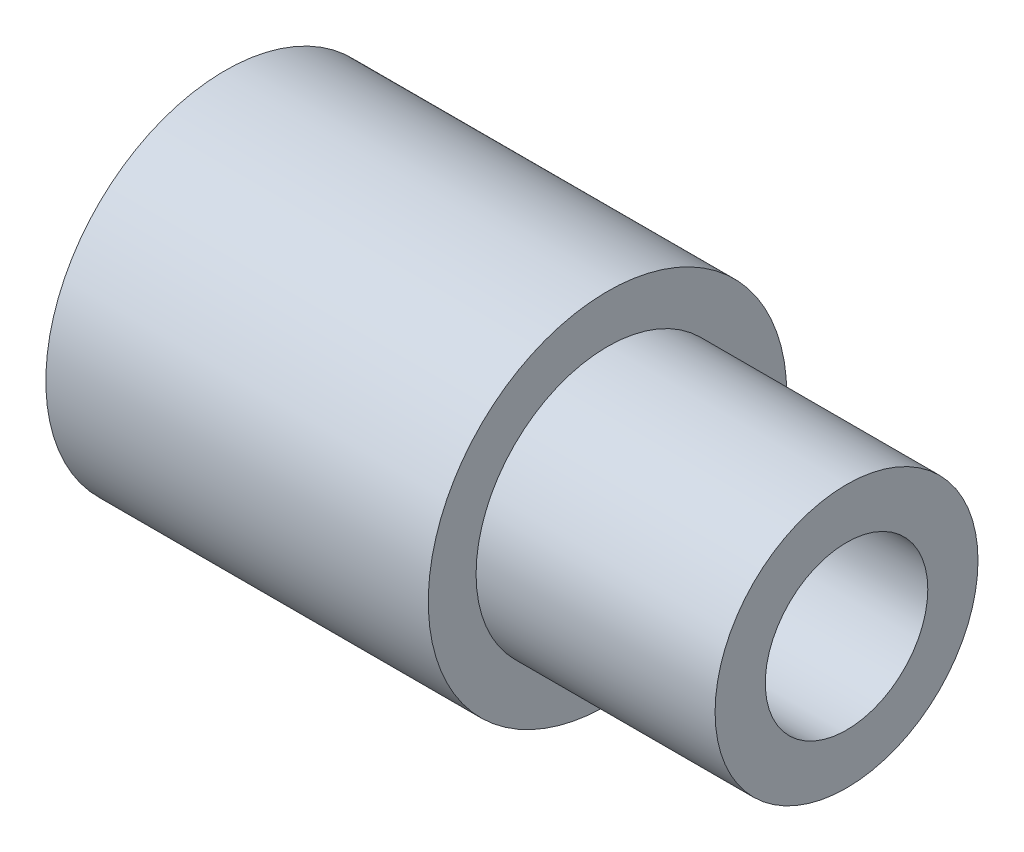
ISO-10303-21;
HEADER;
FILE_DESCRIPTION(('STEP AP214'),'2;1');
FILE_NAME('part.step','',(''),(''),'','','');
FILE_SCHEMA(('AUTOMOTIVE_DESIGN { 1 0 10303 214 1 1 1 1 }'));
ENDSEC;
DATA;
#1=APPLICATION_CONTEXT('core data for automotive mechanical design processes');
#2=APPLICATION_PROTOCOL_DEFINITION('international standard','automotive_design',2000,#1);
#3=PRODUCT_CONTEXT('',#1,'mechanical');
#4=PRODUCT('Part','Part','',(#3));
#5=PRODUCT_RELATED_PRODUCT_CATEGORY('part','',(#4));
#6=PRODUCT_DEFINITION_FORMATION('','',#4);
#7=PRODUCT_DEFINITION_CONTEXT('part definition',#1,'design');
#8=PRODUCT_DEFINITION('design','',#6,#7);
#9=PRODUCT_DEFINITION_SHAPE('','',#8);
#10=(LENGTH_UNIT() NAMED_UNIT(*) SI_UNIT(.MILLI.,.METRE.));
#11=(NAMED_UNIT(*) PLANE_ANGLE_UNIT() SI_UNIT($,.RADIAN.));
#12=(NAMED_UNIT(*) SI_UNIT($,.STERADIAN.) SOLID_ANGLE_UNIT());
#13=UNCERTAINTY_MEASURE_WITH_UNIT(LENGTH_MEASURE(1.E-05),#10,'distance_accuracy_value','');
#14=(GEOMETRIC_REPRESENTATION_CONTEXT(3) GLOBAL_UNCERTAINTY_ASSIGNED_CONTEXT((#13)) GLOBAL_UNIT_ASSIGNED_CONTEXT((#10,
#11,#12)) REPRESENTATION_CONTEXT('',''));
#15=CARTESIAN_POINT('',(0.,0.,0.));
#16=DIRECTION('',(0.,0.,1.));
#17=DIRECTION('',(1.,0.,0.));
#18=AXIS2_PLACEMENT_3D('',#15,#16,#17);
#19=CARTESIAN_POINT('',(13.,0.,0.));
#20=DIRECTION('',(1.,0.,0.));
#21=DIRECTION('',(0.,0.,-1.));
#22=AXIS2_PLACEMENT_3D('',#19,#20,#21);
#23=PLANE('',#22);
#24=CARTESIAN_POINT('',(13.,0.,0.));
#25=DIRECTION('',(1.,0.,0.));
#26=DIRECTION('',(0.,0.,-1.));
#27=AXIS2_PLACEMENT_3D('',#24,#25,#26);
#28=CIRCLE('',#27,1.7);
#29=CARTESIAN_POINT('',(13.,0.,-1.7));
#30=VERTEX_POINT('',#29);
#31=EDGE_CURVE('E41',#30,#30,#28,.T.);
#32=ORIENTED_EDGE('',*,*,#31,.F.);
#33=EDGE_LOOP('',(#32));
#34=FACE_BOUND('',#33,.T.);
#35=CARTESIAN_POINT('',(13.,0.,0.));
#36=DIRECTION('',(1.,0.,0.));
#37=DIRECTION('',(0.,0.,-1.));
#38=AXIS2_PLACEMENT_3D('',#35,#36,#37);
#39=CIRCLE('',#38,2.75);
#40=CARTESIAN_POINT('',(13.,0.,-2.75));
#41=VERTEX_POINT('',#40);
#42=EDGE_CURVE('E50',#41,#41,#39,.T.);
#43=ORIENTED_EDGE('',*,*,#42,.T.);
#44=EDGE_LOOP('',(#43));
#45=FACE_BOUND('',#44,.T.);
#46=ADVANCED_FACE('F33',(#34,#45),#23,.T.);
#47=CARTESIAN_POINT('',(13.,0.,0.));
#48=DIRECTION('',(-1.,0.,0.));
#49=DIRECTION('',(0.,0.,1.));
#50=AXIS2_PLACEMENT_3D('',#47,#48,#49);
#51=CYLINDRICAL_SURFACE('',#50,3.75);
#52=CARTESIAN_POINT('',(0.,0.,0.));
#53=DIRECTION('',(1.,0.,0.));
#54=DIRECTION('',(0.,0.,-1.));
#55=AXIS2_PLACEMENT_3D('',#52,#53,#54);
#56=CIRCLE('',#55,3.75);
#57=CARTESIAN_POINT('',(0.,0.,-3.75));
#58=VERTEX_POINT('',#57);
#59=EDGE_CURVE('E10',#58,#58,#56,.T.);
#60=ORIENTED_EDGE('',*,*,#59,.T.);
#61=EDGE_LOOP('',(#60));
#62=FACE_BOUND('',#61,.T.);
#63=CARTESIAN_POINT('',(8.,0.,0.));
#64=DIRECTION('',(1.,0.,0.));
#65=DIRECTION('',(0.,0.,-1.));
#66=AXIS2_PLACEMENT_3D('',#63,#64,#65);
#67=CIRCLE('',#66,3.75);
#68=CARTESIAN_POINT('',(8.,0.,-3.75));
#69=VERTEX_POINT('',#68);
#70=EDGE_CURVE('E37',#69,#69,#67,.T.);
#71=ORIENTED_EDGE('',*,*,#70,.F.);
#72=EDGE_LOOP('',(#71));
#73=FACE_BOUND('',#72,.T.);
#74=ADVANCED_FACE('F35',(#62,#73),#51,.T.);
#75=CARTESIAN_POINT('',(0.,0.,0.));
#76=DIRECTION('',(1.,0.,0.));
#77=DIRECTION('',(0.,0.,-1.));
#78=AXIS2_PLACEMENT_3D('',#75,#76,#77);
#79=PLANE('',#78);
#80=ORIENTED_EDGE('',*,*,#59,.F.);
#81=EDGE_LOOP('',(#80));
#82=FACE_BOUND('',#81,.T.);
#83=CARTESIAN_POINT('',(0.,0.,0.));
#84=DIRECTION('',(1.,0.,0.));
#85=DIRECTION('',(0.,0.,-1.));
#86=AXIS2_PLACEMENT_3D('',#83,#84,#85);
#87=CIRCLE('',#86,1.7);
#88=CARTESIAN_POINT('',(0.,0.,-1.7));
#89=VERTEX_POINT('',#88);
#90=EDGE_CURVE('E45',#89,#89,#87,.T.);
#91=ORIENTED_EDGE('',*,*,#90,.T.);
#92=EDGE_LOOP('',(#91));
#93=FACE_BOUND('',#92,.T.);
#94=ADVANCED_FACE('F63',(#82,#93),#79,.F.);
#95=CARTESIAN_POINT('',(13.,0.,0.));
#96=DIRECTION('',(-1.,0.,0.));
#97=DIRECTION('',(0.,0.,1.));
#98=AXIS2_PLACEMENT_3D('',#95,#96,#97);
#99=CYLINDRICAL_SURFACE('',#98,1.7);
#100=ORIENTED_EDGE('',*,*,#31,.T.);
#101=EDGE_LOOP('',(#100));
#102=FACE_BOUND('',#101,.T.);
#103=ORIENTED_EDGE('',*,*,#90,.F.);
#104=EDGE_LOOP('',(#103));
#105=FACE_BOUND('',#104,.T.);
#106=ADVANCED_FACE('F68',(#102,#105),#99,.F.);
#107=CARTESIAN_POINT('',(8.,0.,0.));
#108=DIRECTION('',(1.,0.,0.));
#109=DIRECTION('',(0.,0.,-1.));
#110=AXIS2_PLACEMENT_3D('',#107,#108,#109);
#111=PLANE('',#110);
#112=CARTESIAN_POINT('',(8.,0.,0.));
#113=DIRECTION('',(1.,0.,0.));
#114=DIRECTION('',(0.,0.,-1.));
#115=AXIS2_PLACEMENT_3D('',#112,#113,#114);
#116=CIRCLE('',#115,2.75);
#117=CARTESIAN_POINT('',(8.,0.,-2.75));
#118=VERTEX_POINT('',#117);
#119=EDGE_CURVE('E53',#118,#118,#116,.T.);
#120=ORIENTED_EDGE('',*,*,#119,.F.);
#121=EDGE_LOOP('',(#120));
#122=FACE_BOUND('',#121,.T.);
#123=ORIENTED_EDGE('',*,*,#70,.T.);
#124=EDGE_LOOP('',(#123));
#125=FACE_BOUND('',#124,.T.);
#126=ADVANCED_FACE('F60',(#122,#125),#111,.T.);
#127=CARTESIAN_POINT('',(8.,0.,0.));
#128=DIRECTION('',(1.,0.,0.));
#129=DIRECTION('',(0.,0.,-1.));
#130=AXIS2_PLACEMENT_3D('',#127,#128,#129);
#131=CYLINDRICAL_SURFACE('',#130,2.75);
#132=ORIENTED_EDGE('',*,*,#119,.T.);
#133=EDGE_LOOP('',(#132));
#134=FACE_BOUND('',#133,.T.);
#135=ORIENTED_EDGE('',*,*,#42,.F.);
#136=EDGE_LOOP('',(#135));
#137=FACE_BOUND('',#136,.T.);
#138=ADVANCED_FACE('F82',(#134,#137),#131,.T.);
#139=CLOSED_SHELL('',(#46,#74,#94,#106,#126,#138));
#140=MANIFOLD_SOLID_BREP('B2',#139);
#141=ADVANCED_BREP_SHAPE_REPRESENTATION('',(#18,#140),#14);
#142=SHAPE_DEFINITION_REPRESENTATION(#9,#141);
ENDSEC;
END-ISO-10303-21;
